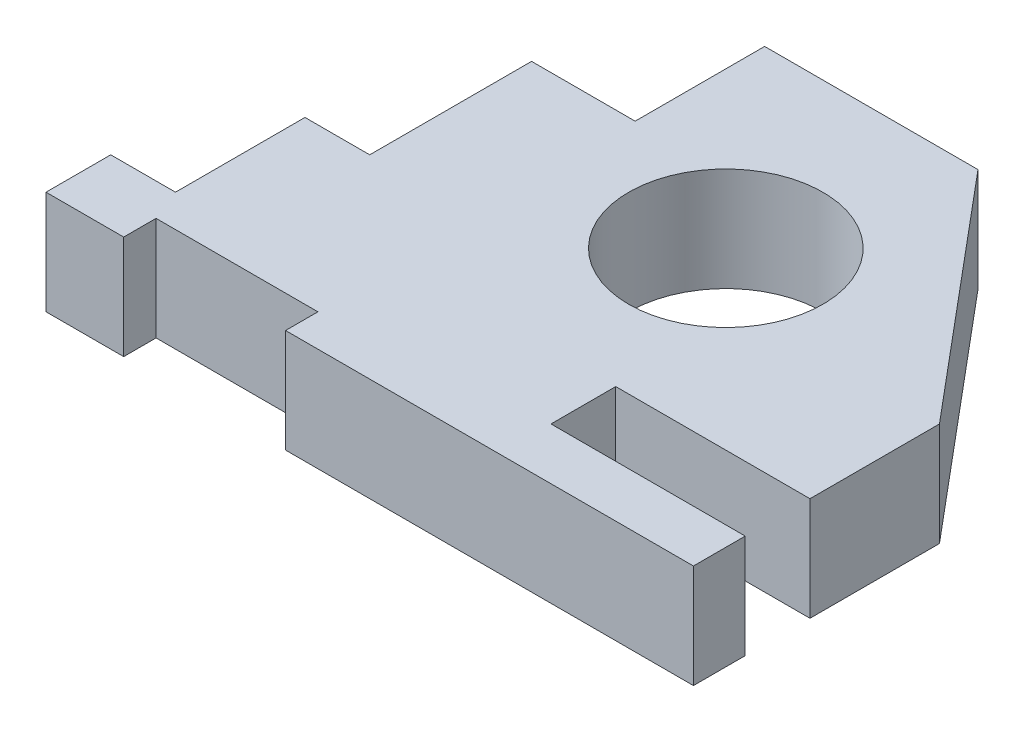
ISO-10303-21;
HEADER;
FILE_DESCRIPTION(('STEP AP214'),'2;1');
FILE_NAME('part.step','',(''),(''),'','','');
FILE_SCHEMA(('AUTOMOTIVE_DESIGN { 1 0 10303 214 1 1 1 1 }'));
ENDSEC;
DATA;
#1=APPLICATION_CONTEXT('core data for automotive mechanical design processes');
#2=APPLICATION_PROTOCOL_DEFINITION('international standard','automotive_design',2000,#1);
#3=PRODUCT_CONTEXT('',#1,'mechanical');
#4=PRODUCT('Part','Part','',(#3));
#5=PRODUCT_RELATED_PRODUCT_CATEGORY('part','',(#4));
#6=PRODUCT_DEFINITION_FORMATION('','',#4);
#7=PRODUCT_DEFINITION_CONTEXT('part definition',#1,'design');
#8=PRODUCT_DEFINITION('design','',#6,#7);
#9=PRODUCT_DEFINITION_SHAPE('','',#8);
#10=(LENGTH_UNIT() NAMED_UNIT(*) SI_UNIT(.MILLI.,.METRE.));
#11=(NAMED_UNIT(*) PLANE_ANGLE_UNIT() SI_UNIT($,.RADIAN.));
#12=(NAMED_UNIT(*) SI_UNIT($,.STERADIAN.) SOLID_ANGLE_UNIT());
#13=UNCERTAINTY_MEASURE_WITH_UNIT(LENGTH_MEASURE(1.E-05),#10,'distance_accuracy_value','');
#14=(GEOMETRIC_REPRESENTATION_CONTEXT(3) GLOBAL_UNCERTAINTY_ASSIGNED_CONTEXT((#13)) GLOBAL_UNIT_ASSIGNED_CONTEXT((#10,
#11,#12)) REPRESENTATION_CONTEXT('',''));
#15=CARTESIAN_POINT('',(0.,0.,0.));
#16=DIRECTION('',(0.,0.,1.));
#17=DIRECTION('',(1.,0.,0.));
#18=AXIS2_PLACEMENT_3D('',#15,#16,#17);
#19=CARTESIAN_POINT('',(0.,16.,0.));
#20=DIRECTION('',(0.,-1.,0.));
#21=DIRECTION('',(0.,0.,-1.));
#22=AXIS2_PLACEMENT_3D('',#19,#20,#21);
#23=PLANE('',#22);
#24=DIRECTION('',(0.,0.,1.));
#25=VECTOR('',#24,1.);
#26=CARTESIAN_POINT('',(0.,16.,0.));
#27=LINE('',#26,#25);
#28=CARTESIAN_POINT('',(0.,16.,-10.));
#29=VERTEX_POINT('',#28);
#30=CARTESIAN_POINT('',(0.,16.,0.));
#31=VERTEX_POINT('',#30);
#32=EDGE_CURVE('E263',#29,#31,#27,.T.);
#33=ORIENTED_EDGE('',*,*,#32,.T.);
#34=DIRECTION('',(1.,0.,0.));
#35=VECTOR('',#34,1.);
#36=CARTESIAN_POINT('',(0.,16.,0.));
#37=LINE('',#36,#35);
#38=CARTESIAN_POINT('',(12.,16.,0.));
#39=VERTEX_POINT('',#38);
#40=EDGE_CURVE('E133',#31,#39,#37,.T.);
#41=ORIENTED_EDGE('',*,*,#40,.T.);
#42=DIRECTION('',(0.,0.,-1.));
#43=VECTOR('',#42,1.);
#44=CARTESIAN_POINT('',(12.,16.,0.));
#45=LINE('',#44,#43);
#46=CARTESIAN_POINT('',(12.,16.,-5.));
#47=VERTEX_POINT('',#46);
#48=EDGE_CURVE('E328',#39,#47,#45,.T.);
#49=ORIENTED_EDGE('',*,*,#48,.T.);
#50=DIRECTION('',(1.,0.,0.));
#51=VECTOR('',#50,1.);
#52=CARTESIAN_POINT('',(12.,16.,-5.));
#53=LINE('',#52,#51);
#54=CARTESIAN_POINT('',(37.,16.,-5.));
#55=VERTEX_POINT('',#54);
#56=EDGE_CURVE('E348',#47,#55,#53,.T.);
#57=ORIENTED_EDGE('',*,*,#56,.T.);
#58=DIRECTION('',(0.,0.,1.));
#59=VECTOR('',#58,1.);
#60=CARTESIAN_POINT('',(37.,16.,-5.));
#61=LINE('',#60,#59);
#62=CARTESIAN_POINT('',(37.,16.,0.));
#63=VERTEX_POINT('',#62);
#64=EDGE_CURVE('E344',#55,#63,#61,.T.);
#65=ORIENTED_EDGE('',*,*,#64,.T.);
#66=DIRECTION('',(1.,0.,0.));
#67=VECTOR('',#66,1.);
#68=CARTESIAN_POINT('',(37.,16.,0.));
#69=LINE('',#68,#67);
#70=CARTESIAN_POINT('',(100.,16.,0.));
#71=VERTEX_POINT('',#70);
#72=EDGE_CURVE('E347',#63,#71,#69,.T.);
#73=ORIENTED_EDGE('',*,*,#72,.T.);
#74=DIRECTION('',(0.,0.,-1.));
#75=VECTOR('',#74,1.);
#76=CARTESIAN_POINT('',(100.,16.,0.));
#77=LINE('',#76,#75);
#78=CARTESIAN_POINT('',(100.,16.,-8.));
#79=VERTEX_POINT('',#78);
#80=EDGE_CURVE('E352',#71,#79,#77,.T.);
#81=ORIENTED_EDGE('',*,*,#80,.T.);
#82=DIRECTION('',(-1.,0.,0.));
#83=VECTOR('',#82,1.);
#84=CARTESIAN_POINT('',(100.,16.,-8.));
#85=LINE('',#84,#83);
#86=CARTESIAN_POINT('',(70.,16.,-8.));
#87=VERTEX_POINT('',#86);
#88=EDGE_CURVE('E359',#79,#87,#85,.T.);
#89=ORIENTED_EDGE('',*,*,#88,.T.);
#90=DIRECTION('',(0.,0.,-1.));
#91=VECTOR('',#90,1.);
#92=CARTESIAN_POINT('',(70.,16.,-8.));
#93=LINE('',#92,#91);
#94=CARTESIAN_POINT('',(70.,16.,-18.));
#95=VERTEX_POINT('',#94);
#96=EDGE_CURVE('E362',#87,#95,#93,.T.);
#97=ORIENTED_EDGE('',*,*,#96,.T.);
#98=DIRECTION('',(1.,0.,0.));
#99=VECTOR('',#98,1.);
#100=CARTESIAN_POINT('',(70.,16.,-18.));
#101=LINE('',#100,#99);
#102=CARTESIAN_POINT('',(100.,16.,-18.));
#103=VERTEX_POINT('',#102);
#104=EDGE_CURVE('E365',#95,#103,#101,.T.);
#105=ORIENTED_EDGE('',*,*,#104,.T.);
#106=DIRECTION('',(0.,0.,-1.));
#107=VECTOR('',#106,1.);
#108=CARTESIAN_POINT('',(100.,16.,-18.));
#109=LINE('',#108,#107);
#110=CARTESIAN_POINT('',(100.,16.,-38.));
#111=VERTEX_POINT('',#110);
#112=EDGE_CURVE('E368',#103,#111,#109,.T.);
#113=ORIENTED_EDGE('',*,*,#112,.T.);
#114=DIRECTION('',(-0.642787609686535,0.,-0.766044443118982));
#115=VECTOR('',#114,1.);
#116=CARTESIAN_POINT('',(68.953313646441,16.,-75.));
#117=LINE('',#116,#115);
#118=CARTESIAN_POINT('',(68.953313646441,16.,-75.));
#119=VERTEX_POINT('',#118);
#120=EDGE_CURVE('E371',#111,#119,#117,.T.);
#121=ORIENTED_EDGE('',*,*,#120,.T.);
#122=DIRECTION('',(-1.,0.,0.));
#123=VECTOR('',#122,1.);
#124=CARTESIAN_POINT('',(36.,16.,-75.));
#125=LINE('',#124,#123);
#126=CARTESIAN_POINT('',(36.,16.,-75.));
#127=VERTEX_POINT('',#126);
#128=EDGE_CURVE('E374',#119,#127,#125,.T.);
#129=ORIENTED_EDGE('',*,*,#128,.T.);
#130=DIRECTION('',(0.,0.,1.));
#131=VECTOR('',#130,1.);
#132=CARTESIAN_POINT('',(36.,16.,-55.));
#133=LINE('',#132,#131);
#134=CARTESIAN_POINT('',(36.,16.,-55.));
#135=VERTEX_POINT('',#134);
#136=EDGE_CURVE('E377',#127,#135,#133,.T.);
#137=ORIENTED_EDGE('',*,*,#136,.T.);
#138=DIRECTION('',(-1.,0.,0.));
#139=VECTOR('',#138,1.);
#140=CARTESIAN_POINT('',(20.,16.,-55.));
#141=LINE('',#140,#139);
#142=CARTESIAN_POINT('',(20.,16.,-55.));
#143=VERTEX_POINT('',#142);
#144=EDGE_CURVE('E380',#135,#143,#141,.T.);
#145=ORIENTED_EDGE('',*,*,#144,.T.);
#146=DIRECTION('',(0.,0.,1.));
#147=VECTOR('',#146,1.);
#148=CARTESIAN_POINT('',(20.,16.,-30.));
#149=LINE('',#148,#147);
#150=CARTESIAN_POINT('',(20.,16.,-30.));
#151=VERTEX_POINT('',#150);
#152=EDGE_CURVE('E185',#143,#151,#149,.T.);
#153=ORIENTED_EDGE('',*,*,#152,.T.);
#154=DIRECTION('',(-1.,0.,0.));
#155=VECTOR('',#154,1.);
#156=CARTESIAN_POINT('',(10.,16.,-30.));
#157=LINE('',#156,#155);
#158=CARTESIAN_POINT('',(10.,16.,-30.));
#159=VERTEX_POINT('',#158);
#160=EDGE_CURVE('E179',#151,#159,#157,.T.);
#161=ORIENTED_EDGE('',*,*,#160,.T.);
#162=DIRECTION('',(0.,0.,1.));
#163=VECTOR('',#162,1.);
#164=CARTESIAN_POINT('',(10.,16.,-10.));
#165=LINE('',#164,#163);
#166=CARTESIAN_POINT('',(10.,16.,-10.));
#167=VERTEX_POINT('',#166);
#168=EDGE_CURVE('E183',#159,#167,#165,.T.);
#169=ORIENTED_EDGE('',*,*,#168,.T.);
#170=DIRECTION('',(-1.,0.,0.));
#171=VECTOR('',#170,1.);
#172=CARTESIAN_POINT('',(0.,16.,-10.));
#173=LINE('',#172,#171);
#174=EDGE_CURVE('E57',#167,#29,#173,.T.);
#175=ORIENTED_EDGE('',*,*,#174,.T.);
#176=EDGE_LOOP('',(#33,#41,#49,#57,#65,#73,#81,#89,#97,#105,#113,#121,#129,#137,#145,#153,#161,
#169,#175));
#177=FACE_BOUND('',#176,.T.);
#178=CARTESIAN_POINT('',(60.,16.,-45.));
#179=DIRECTION('',(0.,1.,0.));
#180=DIRECTION('',(0.,0.,1.));
#181=AXIS2_PLACEMENT_3D('',#178,#179,#180);
#182=CIRCLE('',#181,15.);
#183=CARTESIAN_POINT('',(60.,16.,-30.));
#184=VERTEX_POINT('',#183);
#185=EDGE_CURVE('E212',#184,#184,#182,.T.);
#186=ORIENTED_EDGE('',*,*,#185,.F.);
#187=EDGE_LOOP('',(#186));
#188=FACE_BOUND('',#187,.T.);
#189=ADVANCED_FACE('F39',(#177,#188),#23,.F.);
#190=CARTESIAN_POINT('',(0.,0.,0.));
#191=DIRECTION('',(0.,-1.,0.));
#192=DIRECTION('',(0.,0.,-1.));
#193=AXIS2_PLACEMENT_3D('',#190,#191,#192);
#194=PLANE('',#193);
#195=DIRECTION('',(0.,0.,1.));
#196=VECTOR('',#195,1.);
#197=CARTESIAN_POINT('',(0.,0.,0.));
#198=LINE('',#197,#196);
#199=CARTESIAN_POINT('',(0.,0.,-10.));
#200=VERTEX_POINT('',#199);
#201=CARTESIAN_POINT('',(0.,0.,0.));
#202=VERTEX_POINT('',#201);
#203=EDGE_CURVE('E207',#200,#202,#198,.T.);
#204=ORIENTED_EDGE('',*,*,#203,.F.);
#205=DIRECTION('',(-1.,0.,0.));
#206=VECTOR('',#205,1.);
#207=CARTESIAN_POINT('',(0.,0.,-10.));
#208=LINE('',#207,#206);
#209=CARTESIAN_POINT('',(10.,0.,-10.));
#210=VERTEX_POINT('',#209);
#211=EDGE_CURVE('E125',#210,#200,#208,.T.);
#212=ORIENTED_EDGE('',*,*,#211,.F.);
#213=DIRECTION('',(0.,0.,1.));
#214=VECTOR('',#213,1.);
#215=CARTESIAN_POINT('',(10.,0.,-10.));
#216=LINE('',#215,#214);
#217=CARTESIAN_POINT('',(10.,0.,-30.));
#218=VERTEX_POINT('',#217);
#219=EDGE_CURVE('E119',#218,#210,#216,.T.);
#220=ORIENTED_EDGE('',*,*,#219,.F.);
#221=DIRECTION('',(-1.,0.,0.));
#222=VECTOR('',#221,1.);
#223=CARTESIAN_POINT('',(10.,0.,-30.));
#224=LINE('',#223,#222);
#225=CARTESIAN_POINT('',(20.,0.,-30.));
#226=VERTEX_POINT('',#225);
#227=EDGE_CURVE('E194',#226,#218,#224,.T.);
#228=ORIENTED_EDGE('',*,*,#227,.F.);
#229=DIRECTION('',(0.,0.,1.));
#230=VECTOR('',#229,1.);
#231=CARTESIAN_POINT('',(20.,0.,-30.));
#232=LINE('',#231,#230);
#233=CARTESIAN_POINT('',(20.,0.,-55.));
#234=VERTEX_POINT('',#233);
#235=EDGE_CURVE('E254',#234,#226,#232,.T.);
#236=ORIENTED_EDGE('',*,*,#235,.F.);
#237=DIRECTION('',(-1.,0.,0.));
#238=VECTOR('',#237,1.);
#239=CARTESIAN_POINT('',(20.,0.,-55.));
#240=LINE('',#239,#238);
#241=CARTESIAN_POINT('',(36.,0.,-55.));
#242=VERTEX_POINT('',#241);
#243=EDGE_CURVE('E251',#242,#234,#240,.T.);
#244=ORIENTED_EDGE('',*,*,#243,.F.);
#245=DIRECTION('',(0.,0.,1.));
#246=VECTOR('',#245,1.);
#247=CARTESIAN_POINT('',(36.,0.,-55.));
#248=LINE('',#247,#246);
#249=CARTESIAN_POINT('',(36.,0.,-75.));
#250=VERTEX_POINT('',#249);
#251=EDGE_CURVE('E248',#250,#242,#248,.T.);
#252=ORIENTED_EDGE('',*,*,#251,.F.);
#253=DIRECTION('',(-1.,0.,0.));
#254=VECTOR('',#253,1.);
#255=CARTESIAN_POINT('',(36.,0.,-75.));
#256=LINE('',#255,#254);
#257=CARTESIAN_POINT('',(68.953313646441,0.,-75.));
#258=VERTEX_POINT('',#257);
#259=EDGE_CURVE('E245',#258,#250,#256,.T.);
#260=ORIENTED_EDGE('',*,*,#259,.F.);
#261=DIRECTION('',(-0.642787609686535,0.,-0.766044443118982));
#262=VECTOR('',#261,1.);
#263=CARTESIAN_POINT('',(68.953313646441,0.,-75.));
#264=LINE('',#263,#262);
#265=CARTESIAN_POINT('',(100.,0.,-38.));
#266=VERTEX_POINT('',#265);
#267=EDGE_CURVE('E242',#266,#258,#264,.T.);
#268=ORIENTED_EDGE('',*,*,#267,.F.);
#269=DIRECTION('',(0.,0.,-1.));
#270=VECTOR('',#269,1.);
#271=CARTESIAN_POINT('',(100.,0.,-18.));
#272=LINE('',#271,#270);
#273=CARTESIAN_POINT('',(100.,0.,-18.));
#274=VERTEX_POINT('',#273);
#275=EDGE_CURVE('E239',#274,#266,#272,.T.);
#276=ORIENTED_EDGE('',*,*,#275,.F.);
#277=DIRECTION('',(1.,0.,0.));
#278=VECTOR('',#277,1.);
#279=CARTESIAN_POINT('',(70.,0.,-18.));
#280=LINE('',#279,#278);
#281=CARTESIAN_POINT('',(70.,0.,-18.));
#282=VERTEX_POINT('',#281);
#283=EDGE_CURVE('E236',#282,#274,#280,.T.);
#284=ORIENTED_EDGE('',*,*,#283,.F.);
#285=DIRECTION('',(0.,0.,-1.));
#286=VECTOR('',#285,1.);
#287=CARTESIAN_POINT('',(70.,0.,-8.));
#288=LINE('',#287,#286);
#289=CARTESIAN_POINT('',(70.,0.,-8.));
#290=VERTEX_POINT('',#289);
#291=EDGE_CURVE('E233',#290,#282,#288,.T.);
#292=ORIENTED_EDGE('',*,*,#291,.F.);
#293=DIRECTION('',(-1.,0.,0.));
#294=VECTOR('',#293,1.);
#295=CARTESIAN_POINT('',(100.,0.,-8.));
#296=LINE('',#295,#294);
#297=CARTESIAN_POINT('',(100.,0.,-8.));
#298=VERTEX_POINT('',#297);
#299=EDGE_CURVE('E230',#298,#290,#296,.T.);
#300=ORIENTED_EDGE('',*,*,#299,.F.);
#301=DIRECTION('',(0.,0.,-1.));
#302=VECTOR('',#301,1.);
#303=CARTESIAN_POINT('',(100.,0.,0.));
#304=LINE('',#303,#302);
#305=CARTESIAN_POINT('',(100.,0.,0.));
#306=VERTEX_POINT('',#305);
#307=EDGE_CURVE('E227',#306,#298,#304,.T.);
#308=ORIENTED_EDGE('',*,*,#307,.F.);
#309=DIRECTION('',(1.,0.,0.));
#310=VECTOR('',#309,1.);
#311=CARTESIAN_POINT('',(37.,0.,0.));
#312=LINE('',#311,#310);
#313=CARTESIAN_POINT('',(37.,0.,0.));
#314=VERTEX_POINT('',#313);
#315=EDGE_CURVE('E224',#314,#306,#312,.T.);
#316=ORIENTED_EDGE('',*,*,#315,.F.);
#317=DIRECTION('',(0.,0.,1.));
#318=VECTOR('',#317,1.);
#319=CARTESIAN_POINT('',(37.,0.,-5.));
#320=LINE('',#319,#318);
#321=CARTESIAN_POINT('',(37.,0.,-5.));
#322=VERTEX_POINT('',#321);
#323=EDGE_CURVE('E221',#322,#314,#320,.T.);
#324=ORIENTED_EDGE('',*,*,#323,.F.);
#325=DIRECTION('',(1.,0.,0.));
#326=VECTOR('',#325,1.);
#327=CARTESIAN_POINT('',(12.,0.,-5.));
#328=LINE('',#327,#326);
#329=CARTESIAN_POINT('',(12.,0.,-5.));
#330=VERTEX_POINT('',#329);
#331=EDGE_CURVE('E218',#330,#322,#328,.T.);
#332=ORIENTED_EDGE('',*,*,#331,.F.);
#333=DIRECTION('',(0.,0.,-1.));
#334=VECTOR('',#333,1.);
#335=CARTESIAN_POINT('',(12.,0.,0.));
#336=LINE('',#335,#334);
#337=CARTESIAN_POINT('',(12.,0.,0.));
#338=VERTEX_POINT('',#337);
#339=EDGE_CURVE('E215',#338,#330,#336,.T.);
#340=ORIENTED_EDGE('',*,*,#339,.F.);
#341=DIRECTION('',(1.,0.,0.));
#342=VECTOR('',#341,1.);
#343=CARTESIAN_POINT('',(0.,0.,0.));
#344=LINE('',#343,#342);
#345=EDGE_CURVE('E211',#202,#338,#344,.T.);
#346=ORIENTED_EDGE('',*,*,#345,.F.);
#347=EDGE_LOOP('',(#204,#212,#220,#228,#236,#244,#252,#260,#268,#276,#284,#292,#300,#308,#316,
#324,#332,#340,#346));
#348=FACE_BOUND('',#347,.T.);
#349=CARTESIAN_POINT('',(60.,0.,-45.));
#350=DIRECTION('',(0.,1.,0.));
#351=DIRECTION('',(0.,0.,1.));
#352=AXIS2_PLACEMENT_3D('',#349,#350,#351);
#353=CIRCLE('',#352,15.);
#354=CARTESIAN_POINT('',(60.,0.,-30.));
#355=VERTEX_POINT('',#354);
#356=EDGE_CURVE('E620',#355,#355,#353,.T.);
#357=ORIENTED_EDGE('',*,*,#356,.T.);
#358=EDGE_LOOP('',(#357));
#359=FACE_BOUND('',#358,.T.);
#360=ADVANCED_FACE('F332',(#348,#359),#194,.T.);
#361=CARTESIAN_POINT('',(0.,16.,0.));
#362=DIRECTION('',(1.,0.,0.));
#363=DIRECTION('',(0.,0.,-1.));
#364=AXIS2_PLACEMENT_3D('',#361,#362,#363);
#365=PLANE('',#364);
#366=ORIENTED_EDGE('',*,*,#203,.T.);
#367=DIRECTION('',(0.,-1.,0.));
#368=VECTOR('',#367,1.);
#369=CARTESIAN_POINT('',(0.,16.,0.));
#370=LINE('',#369,#368);
#371=EDGE_CURVE('E11',#31,#202,#370,.T.);
#372=ORIENTED_EDGE('',*,*,#371,.F.);
#373=ORIENTED_EDGE('',*,*,#32,.F.);
#374=DIRECTION('',(0.,-1.,0.));
#375=VECTOR('',#374,1.);
#376=CARTESIAN_POINT('',(0.,16.,-10.));
#377=LINE('',#376,#375);
#378=EDGE_CURVE('E203',#29,#200,#377,.T.);
#379=ORIENTED_EDGE('',*,*,#378,.T.);
#380=EDGE_LOOP('',(#366,#372,#373,#379));
#381=FACE_BOUND('',#380,.T.);
#382=ADVANCED_FACE('F41',(#381),#365,.F.);
#383=CARTESIAN_POINT('',(0.,16.,0.));
#384=DIRECTION('',(0.,0.,-1.));
#385=DIRECTION('',(-1.,0.,0.));
#386=AXIS2_PLACEMENT_3D('',#383,#384,#385);
#387=PLANE('',#386);
#388=ORIENTED_EDGE('',*,*,#345,.T.);
#389=DIRECTION('',(0.,-1.,0.));
#390=VECTOR('',#389,1.);
#391=CARTESIAN_POINT('',(12.,16.,0.));
#392=LINE('',#391,#390);
#393=EDGE_CURVE('E49',#39,#338,#392,.T.);
#394=ORIENTED_EDGE('',*,*,#393,.F.);
#395=ORIENTED_EDGE('',*,*,#40,.F.);
#396=ORIENTED_EDGE('',*,*,#371,.T.);
#397=EDGE_LOOP('',(#388,#394,#395,#396));
#398=FACE_BOUND('',#397,.T.);
#399=ADVANCED_FACE('F416',(#398),#387,.F.);
#400=CARTESIAN_POINT('',(12.,16.,0.));
#401=DIRECTION('',(-1.,0.,0.));
#402=DIRECTION('',(0.,0.,1.));
#403=AXIS2_PLACEMENT_3D('',#400,#401,#402);
#404=PLANE('',#403);
#405=ORIENTED_EDGE('',*,*,#339,.T.);
#406=DIRECTION('',(0.,-1.,0.));
#407=VECTOR('',#406,1.);
#408=CARTESIAN_POINT('',(12.,16.,-5.));
#409=LINE('',#408,#407);
#410=EDGE_CURVE('E318',#47,#330,#409,.T.);
#411=ORIENTED_EDGE('',*,*,#410,.F.);
#412=ORIENTED_EDGE('',*,*,#48,.F.);
#413=ORIENTED_EDGE('',*,*,#393,.T.);
#414=EDGE_LOOP('',(#405,#411,#412,#413));
#415=FACE_BOUND('',#414,.T.);
#416=ADVANCED_FACE('F326',(#415),#404,.F.);
#417=CARTESIAN_POINT('',(12.,16.,-5.));
#418=DIRECTION('',(0.,0.,-1.));
#419=DIRECTION('',(-1.,0.,0.));
#420=AXIS2_PLACEMENT_3D('',#417,#418,#419);
#421=PLANE('',#420);
#422=ORIENTED_EDGE('',*,*,#331,.T.);
#423=DIRECTION('',(0.,-1.,0.));
#424=VECTOR('',#423,1.);
#425=CARTESIAN_POINT('',(37.,16.,-5.));
#426=LINE('',#425,#424);
#427=EDGE_CURVE('E314',#55,#322,#426,.T.);
#428=ORIENTED_EDGE('',*,*,#427,.F.);
#429=ORIENTED_EDGE('',*,*,#56,.F.);
#430=ORIENTED_EDGE('',*,*,#410,.T.);
#431=EDGE_LOOP('',(#422,#428,#429,#430));
#432=FACE_BOUND('',#431,.T.);
#433=ADVANCED_FACE('F338',(#432),#421,.F.);
#434=CARTESIAN_POINT('',(37.,16.,-5.));
#435=DIRECTION('',(1.,0.,0.));
#436=DIRECTION('',(0.,0.,-1.));
#437=AXIS2_PLACEMENT_3D('',#434,#435,#436);
#438=PLANE('',#437);
#439=ORIENTED_EDGE('',*,*,#323,.T.);
#440=DIRECTION('',(0.,-1.,0.));
#441=VECTOR('',#440,1.);
#442=CARTESIAN_POINT('',(37.,16.,0.));
#443=LINE('',#442,#441);
#444=EDGE_CURVE('E310',#63,#314,#443,.T.);
#445=ORIENTED_EDGE('',*,*,#444,.F.);
#446=ORIENTED_EDGE('',*,*,#64,.F.);
#447=ORIENTED_EDGE('',*,*,#427,.T.);
#448=EDGE_LOOP('',(#439,#445,#446,#447));
#449=FACE_BOUND('',#448,.T.);
#450=ADVANCED_FACE('F342',(#449),#438,.F.);
#451=CARTESIAN_POINT('',(37.,16.,0.));
#452=DIRECTION('',(0.,0.,-1.));
#453=DIRECTION('',(-1.,0.,0.));
#454=AXIS2_PLACEMENT_3D('',#451,#452,#453);
#455=PLANE('',#454);
#456=ORIENTED_EDGE('',*,*,#315,.T.);
#457=DIRECTION('',(0.,-1.,0.));
#458=VECTOR('',#457,1.);
#459=CARTESIAN_POINT('',(100.,16.,0.));
#460=LINE('',#459,#458);
#461=EDGE_CURVE('E306',#71,#306,#460,.T.);
#462=ORIENTED_EDGE('',*,*,#461,.F.);
#463=ORIENTED_EDGE('',*,*,#72,.F.);
#464=ORIENTED_EDGE('',*,*,#444,.T.);
#465=EDGE_LOOP('',(#456,#462,#463,#464));
#466=FACE_BOUND('',#465,.T.);
#467=ADVANCED_FACE('F429',(#466),#455,.F.);
#468=CARTESIAN_POINT('',(100.,16.,0.));
#469=DIRECTION('',(-1.,0.,0.));
#470=DIRECTION('',(0.,0.,1.));
#471=AXIS2_PLACEMENT_3D('',#468,#469,#470);
#472=PLANE('',#471);
#473=ORIENTED_EDGE('',*,*,#307,.T.);
#474=DIRECTION('',(0.,-1.,0.));
#475=VECTOR('',#474,1.);
#476=CARTESIAN_POINT('',(100.,16.,-8.));
#477=LINE('',#476,#475);
#478=EDGE_CURVE('E302',#79,#298,#477,.T.);
#479=ORIENTED_EDGE('',*,*,#478,.F.);
#480=ORIENTED_EDGE('',*,*,#80,.F.);
#481=ORIENTED_EDGE('',*,*,#461,.T.);
#482=EDGE_LOOP('',(#473,#479,#480,#481));
#483=FACE_BOUND('',#482,.T.);
#484=ADVANCED_FACE('F432',(#483),#472,.F.);
#485=CARTESIAN_POINT('',(100.,16.,-8.));
#486=DIRECTION('',(0.,0.,1.));
#487=DIRECTION('',(1.,0.,0.));
#488=AXIS2_PLACEMENT_3D('',#485,#486,#487);
#489=PLANE('',#488);
#490=ORIENTED_EDGE('',*,*,#299,.T.);
#491=DIRECTION('',(0.,-1.,0.));
#492=VECTOR('',#491,1.);
#493=CARTESIAN_POINT('',(70.,16.,-8.));
#494=LINE('',#493,#492);
#495=EDGE_CURVE('E298',#87,#290,#494,.T.);
#496=ORIENTED_EDGE('',*,*,#495,.F.);
#497=ORIENTED_EDGE('',*,*,#88,.F.);
#498=ORIENTED_EDGE('',*,*,#478,.T.);
#499=EDGE_LOOP('',(#490,#496,#497,#498));
#500=FACE_BOUND('',#499,.T.);
#501=ADVANCED_FACE('F436',(#500),#489,.F.);
#502=CARTESIAN_POINT('',(70.,16.,-8.));
#503=DIRECTION('',(-1.,0.,0.));
#504=DIRECTION('',(0.,0.,1.));
#505=AXIS2_PLACEMENT_3D('',#502,#503,#504);
#506=PLANE('',#505);
#507=ORIENTED_EDGE('',*,*,#291,.T.);
#508=DIRECTION('',(0.,-1.,0.));
#509=VECTOR('',#508,1.);
#510=CARTESIAN_POINT('',(70.,16.,-18.));
#511=LINE('',#510,#509);
#512=EDGE_CURVE('E294',#95,#282,#511,.T.);
#513=ORIENTED_EDGE('',*,*,#512,.F.);
#514=ORIENTED_EDGE('',*,*,#96,.F.);
#515=ORIENTED_EDGE('',*,*,#495,.T.);
#516=EDGE_LOOP('',(#507,#513,#514,#515));
#517=FACE_BOUND('',#516,.T.);
#518=ADVANCED_FACE('F440',(#517),#506,.F.);
#519=CARTESIAN_POINT('',(70.,16.,-18.));
#520=DIRECTION('',(0.,0.,-1.));
#521=DIRECTION('',(-1.,0.,0.));
#522=AXIS2_PLACEMENT_3D('',#519,#520,#521);
#523=PLANE('',#522);
#524=ORIENTED_EDGE('',*,*,#283,.T.);
#525=DIRECTION('',(0.,-1.,0.));
#526=VECTOR('',#525,1.);
#527=CARTESIAN_POINT('',(100.,16.,-18.));
#528=LINE('',#527,#526);
#529=EDGE_CURVE('E290',#103,#274,#528,.T.);
#530=ORIENTED_EDGE('',*,*,#529,.F.);
#531=ORIENTED_EDGE('',*,*,#104,.F.);
#532=ORIENTED_EDGE('',*,*,#512,.T.);
#533=EDGE_LOOP('',(#524,#530,#531,#532));
#534=FACE_BOUND('',#533,.T.);
#535=ADVANCED_FACE('F444',(#534),#523,.F.);
#536=CARTESIAN_POINT('',(100.,16.,-18.));
#537=DIRECTION('',(-1.,0.,0.));
#538=DIRECTION('',(0.,0.,1.));
#539=AXIS2_PLACEMENT_3D('',#536,#537,#538);
#540=PLANE('',#539);
#541=ORIENTED_EDGE('',*,*,#275,.T.);
#542=DIRECTION('',(0.,-1.,0.));
#543=VECTOR('',#542,1.);
#544=CARTESIAN_POINT('',(100.,16.,-38.));
#545=LINE('',#544,#543);
#546=EDGE_CURVE('E286',#111,#266,#545,.T.);
#547=ORIENTED_EDGE('',*,*,#546,.F.);
#548=ORIENTED_EDGE('',*,*,#112,.F.);
#549=ORIENTED_EDGE('',*,*,#529,.T.);
#550=EDGE_LOOP('',(#541,#547,#548,#549));
#551=FACE_BOUND('',#550,.T.);
#552=ADVANCED_FACE('F448',(#551),#540,.F.);
#553=CARTESIAN_POINT('',(68.953313646441,16.,-75.));
#554=DIRECTION('',(-0.766044443118982,0.,0.642787609686535));
#555=DIRECTION('',(0.642787609686535,0.,0.766044443118982));
#556=AXIS2_PLACEMENT_3D('',#553,#554,#555);
#557=PLANE('',#556);
#558=ORIENTED_EDGE('',*,*,#267,.T.);
#559=DIRECTION('',(0.,-1.,0.));
#560=VECTOR('',#559,1.);
#561=CARTESIAN_POINT('',(68.953313646441,16.,-75.));
#562=LINE('',#561,#560);
#563=EDGE_CURVE('E282',#119,#258,#562,.T.);
#564=ORIENTED_EDGE('',*,*,#563,.F.);
#565=ORIENTED_EDGE('',*,*,#120,.F.);
#566=ORIENTED_EDGE('',*,*,#546,.T.);
#567=EDGE_LOOP('',(#558,#564,#565,#566));
#568=FACE_BOUND('',#567,.T.);
#569=ADVANCED_FACE('F452',(#568),#557,.F.);
#570=CARTESIAN_POINT('',(36.,16.,-75.));
#571=DIRECTION('',(0.,0.,1.));
#572=DIRECTION('',(1.,0.,0.));
#573=AXIS2_PLACEMENT_3D('',#570,#571,#572);
#574=PLANE('',#573);
#575=ORIENTED_EDGE('',*,*,#259,.T.);
#576=DIRECTION('',(0.,-1.,0.));
#577=VECTOR('',#576,1.);
#578=CARTESIAN_POINT('',(36.,16.,-75.));
#579=LINE('',#578,#577);
#580=EDGE_CURVE('E278',#127,#250,#579,.T.);
#581=ORIENTED_EDGE('',*,*,#580,.F.);
#582=ORIENTED_EDGE('',*,*,#128,.F.);
#583=ORIENTED_EDGE('',*,*,#563,.T.);
#584=EDGE_LOOP('',(#575,#581,#582,#583));
#585=FACE_BOUND('',#584,.T.);
#586=ADVANCED_FACE('F456',(#585),#574,.F.);
#587=CARTESIAN_POINT('',(36.,16.,-55.));
#588=DIRECTION('',(1.,0.,0.));
#589=DIRECTION('',(0.,0.,-1.));
#590=AXIS2_PLACEMENT_3D('',#587,#588,#589);
#591=PLANE('',#590);
#592=ORIENTED_EDGE('',*,*,#251,.T.);
#593=DIRECTION('',(0.,-1.,0.));
#594=VECTOR('',#593,1.);
#595=CARTESIAN_POINT('',(36.,16.,-55.));
#596=LINE('',#595,#594);
#597=EDGE_CURVE('E274',#135,#242,#596,.T.);
#598=ORIENTED_EDGE('',*,*,#597,.F.);
#599=ORIENTED_EDGE('',*,*,#136,.F.);
#600=ORIENTED_EDGE('',*,*,#580,.T.);
#601=EDGE_LOOP('',(#592,#598,#599,#600));
#602=FACE_BOUND('',#601,.T.);
#603=ADVANCED_FACE('F460',(#602),#591,.F.);
#604=CARTESIAN_POINT('',(20.,16.,-55.));
#605=DIRECTION('',(0.,0.,1.));
#606=DIRECTION('',(1.,0.,0.));
#607=AXIS2_PLACEMENT_3D('',#604,#605,#606);
#608=PLANE('',#607);
#609=ORIENTED_EDGE('',*,*,#243,.T.);
#610=DIRECTION('',(0.,-1.,0.));
#611=VECTOR('',#610,1.);
#612=CARTESIAN_POINT('',(20.,16.,-55.));
#613=LINE('',#612,#611);
#614=EDGE_CURVE('E270',#143,#234,#613,.T.);
#615=ORIENTED_EDGE('',*,*,#614,.F.);
#616=ORIENTED_EDGE('',*,*,#144,.F.);
#617=ORIENTED_EDGE('',*,*,#597,.T.);
#618=EDGE_LOOP('',(#609,#615,#616,#617));
#619=FACE_BOUND('',#618,.T.);
#620=ADVANCED_FACE('F388',(#619),#608,.F.);
#621=CARTESIAN_POINT('',(20.,16.,-30.));
#622=DIRECTION('',(1.,0.,0.));
#623=DIRECTION('',(0.,0.,-1.));
#624=AXIS2_PLACEMENT_3D('',#621,#622,#623);
#625=PLANE('',#624);
#626=ORIENTED_EDGE('',*,*,#235,.T.);
#627=DIRECTION('',(0.,-1.,0.));
#628=VECTOR('',#627,1.);
#629=CARTESIAN_POINT('',(20.,16.,-30.));
#630=LINE('',#629,#628);
#631=EDGE_CURVE('E196',#151,#226,#630,.T.);
#632=ORIENTED_EDGE('',*,*,#631,.F.);
#633=ORIENTED_EDGE('',*,*,#152,.F.);
#634=ORIENTED_EDGE('',*,*,#614,.T.);
#635=EDGE_LOOP('',(#626,#632,#633,#634));
#636=FACE_BOUND('',#635,.T.);
#637=ADVANCED_FACE('F392',(#636),#625,.F.);
#638=CARTESIAN_POINT('',(10.,16.,-30.));
#639=DIRECTION('',(0.,0.,1.));
#640=DIRECTION('',(1.,0.,0.));
#641=AXIS2_PLACEMENT_3D('',#638,#639,#640);
#642=PLANE('',#641);
#643=ORIENTED_EDGE('',*,*,#227,.T.);
#644=DIRECTION('',(0.,-1.,0.));
#645=VECTOR('',#644,1.);
#646=CARTESIAN_POINT('',(10.,16.,-30.));
#647=LINE('',#646,#645);
#648=EDGE_CURVE('E191',#159,#218,#647,.T.);
#649=ORIENTED_EDGE('',*,*,#648,.F.);
#650=ORIENTED_EDGE('',*,*,#160,.F.);
#651=ORIENTED_EDGE('',*,*,#631,.T.);
#652=EDGE_LOOP('',(#643,#649,#650,#651));
#653=FACE_BOUND('',#652,.T.);
#654=ADVANCED_FACE('F192',(#653),#642,.F.);
#655=CARTESIAN_POINT('',(10.,16.,-10.));
#656=DIRECTION('',(1.,0.,0.));
#657=DIRECTION('',(0.,0.,-1.));
#658=AXIS2_PLACEMENT_3D('',#655,#656,#657);
#659=PLANE('',#658);
#660=ORIENTED_EDGE('',*,*,#219,.T.);
#661=DIRECTION('',(0.,-1.,0.));
#662=VECTOR('',#661,1.);
#663=CARTESIAN_POINT('',(10.,16.,-10.));
#664=LINE('',#663,#662);
#665=EDGE_CURVE('E197',#167,#210,#664,.T.);
#666=ORIENTED_EDGE('',*,*,#665,.F.);
#667=ORIENTED_EDGE('',*,*,#168,.F.);
#668=ORIENTED_EDGE('',*,*,#648,.T.);
#669=EDGE_LOOP('',(#660,#666,#667,#668));
#670=FACE_BOUND('',#669,.T.);
#671=ADVANCED_FACE('F199',(#670),#659,.F.);
#672=CARTESIAN_POINT('',(0.,16.,-10.));
#673=DIRECTION('',(0.,0.,1.));
#674=DIRECTION('',(1.,0.,0.));
#675=AXIS2_PLACEMENT_3D('',#672,#673,#674);
#676=PLANE('',#675);
#677=ORIENTED_EDGE('',*,*,#211,.T.);
#678=ORIENTED_EDGE('',*,*,#378,.F.);
#679=ORIENTED_EDGE('',*,*,#174,.F.);
#680=ORIENTED_EDGE('',*,*,#665,.T.);
#681=EDGE_LOOP('',(#677,#678,#679,#680));
#682=FACE_BOUND('',#681,.T.);
#683=ADVANCED_FACE('F396',(#682),#676,.F.);
#684=CARTESIAN_POINT('',(60.,16.,-45.));
#685=DIRECTION('',(0.,-1.,0.));
#686=DIRECTION('',(0.,0.,-1.));
#687=AXIS2_PLACEMENT_3D('',#684,#685,#686);
#688=CYLINDRICAL_SURFACE('',#687,15.);
#689=ORIENTED_EDGE('',*,*,#185,.T.);
#690=EDGE_LOOP('',(#689));
#691=FACE_BOUND('',#690,.T.);
#692=ORIENTED_EDGE('',*,*,#356,.F.);
#693=EDGE_LOOP('',(#692));
#694=FACE_BOUND('',#693,.T.);
#695=ADVANCED_FACE('F398',(#691,#694),#688,.F.);
#696=CLOSED_SHELL('',(#189,#360,#382,#399,#416,#433,#450,#467,#484,#501,#518,#535,#552,#569,
#586,#603,#620,#637,#654,#671,#683,#695));
#697=MANIFOLD_SOLID_BREP('B2',#696);
#698=ADVANCED_BREP_SHAPE_REPRESENTATION('',(#18,#697),#14);
#699=SHAPE_DEFINITION_REPRESENTATION(#9,#698);
ENDSEC;
END-ISO-10303-21;
